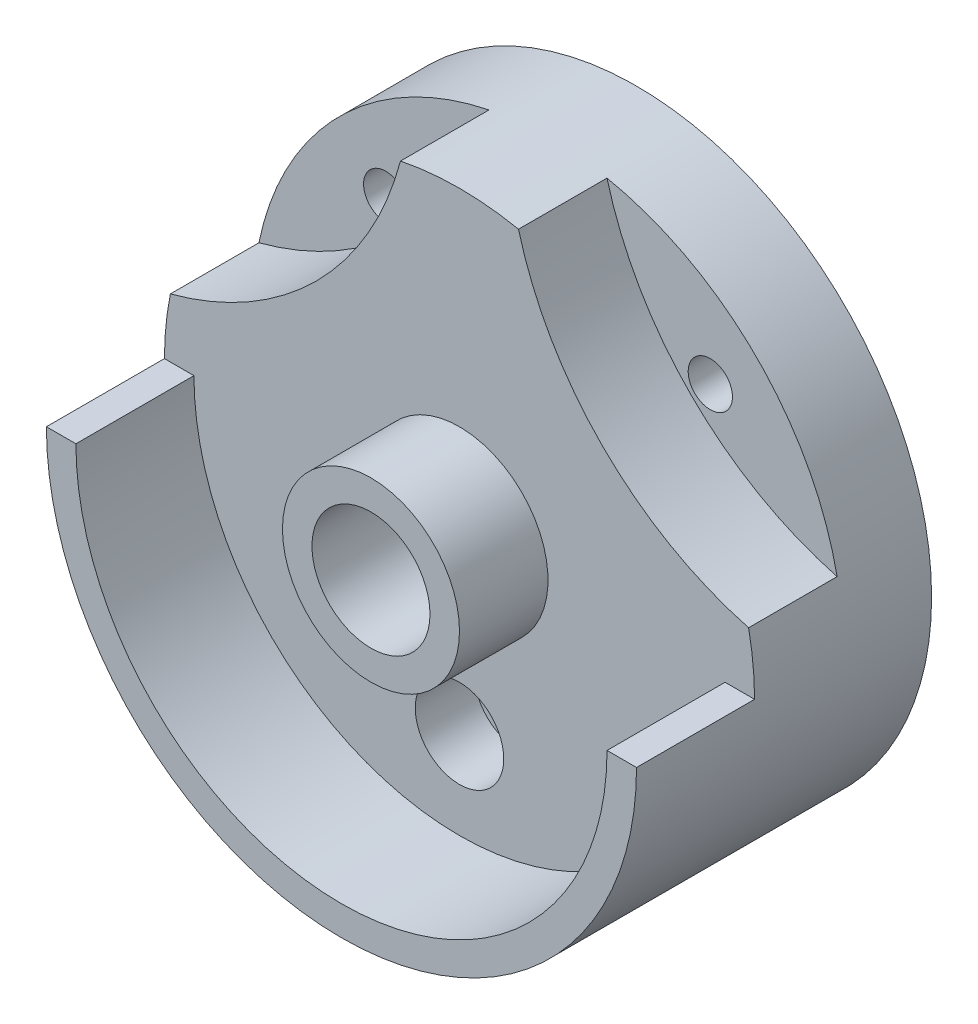
ISO-10303-21;
HEADER;
FILE_DESCRIPTION(('STEP AP214'),'2;1');
FILE_NAME('part.step','',(''),(''),'','','');
FILE_SCHEMA(('AUTOMOTIVE_DESIGN { 1 0 10303 214 1 1 1 1 }'));
ENDSEC;
DATA;
#1=APPLICATION_CONTEXT('core data for automotive mechanical design processes');
#2=APPLICATION_PROTOCOL_DEFINITION('international standard','automotive_design',2000,#1);
#3=PRODUCT_CONTEXT('',#1,'mechanical');
#4=PRODUCT('Part','Part','',(#3));
#5=PRODUCT_RELATED_PRODUCT_CATEGORY('part','',(#4));
#6=PRODUCT_DEFINITION_FORMATION('','',#4);
#7=PRODUCT_DEFINITION_CONTEXT('part definition',#1,'design');
#8=PRODUCT_DEFINITION('design','',#6,#7);
#9=PRODUCT_DEFINITION_SHAPE('','',#8);
#10=(LENGTH_UNIT() NAMED_UNIT(*) SI_UNIT(.MILLI.,.METRE.));
#11=(NAMED_UNIT(*) PLANE_ANGLE_UNIT() SI_UNIT($,.RADIAN.));
#12=(NAMED_UNIT(*) SI_UNIT($,.STERADIAN.) SOLID_ANGLE_UNIT());
#13=UNCERTAINTY_MEASURE_WITH_UNIT(LENGTH_MEASURE(1.E-05),#10,'distance_accuracy_value','');
#14=(GEOMETRIC_REPRESENTATION_CONTEXT(3) GLOBAL_UNCERTAINTY_ASSIGNED_CONTEXT((#13)) GLOBAL_UNIT_ASSIGNED_CONTEXT((#10,
#11,#12)) REPRESENTATION_CONTEXT('',''));
#15=CARTESIAN_POINT('',(0.,0.,0.));
#16=DIRECTION('',(0.,0.,1.));
#17=DIRECTION('',(1.,0.,0.));
#18=AXIS2_PLACEMENT_3D('',#15,#16,#17);
#19=CARTESIAN_POINT('',(0.,0.,60.));
#20=DIRECTION('',(0.,0.,-1.));
#21=DIRECTION('',(-1.,0.,0.));
#22=AXIS2_PLACEMENT_3D('',#19,#20,#21);
#23=PLANE('',#22);
#24=DIRECTION('',(-1.,0.,0.));
#25=VECTOR('',#24,1.);
#26=CARTESIAN_POINT('',(90.,0.,60.));
#27=LINE('',#26,#25);
#28=CARTESIAN_POINT('',(100.,0.,60.));
#29=VERTEX_POINT('',#28);
#30=CARTESIAN_POINT('',(90.,0.,60.));
#31=VERTEX_POINT('',#30);
#32=EDGE_CURVE('E116',#29,#31,#27,.T.);
#33=ORIENTED_EDGE('',*,*,#32,.F.);
#34=CARTESIAN_POINT('',(0.,0.,60.));
#35=DIRECTION('',(0.,0.,-1.));
#36=DIRECTION('',(-1.,0.,0.));
#37=AXIS2_PLACEMENT_3D('',#34,#35,#36);
#38=CIRCLE('',#37,100.);
#39=CARTESIAN_POINT('',(97.9795897113271,20.,60.));
#40=VERTEX_POINT('',#39);
#41=EDGE_CURVE('E136',#40,#29,#38,.T.);
#42=ORIENTED_EDGE('',*,*,#41,.F.);
#43=CARTESIAN_POINT('',(126.293553273105,126.293553273105,60.));
#44=DIRECTION('',(0.,0.,-1.));
#45=DIRECTION('',(-1.,0.,0.));
#46=AXIS2_PLACEMENT_3D('',#43,#44,#45);
#47=CIRCLE('',#46,110.);
#48=CARTESIAN_POINT('',(20.,97.9795897113271,60.));
#49=VERTEX_POINT('',#48);
#50=EDGE_CURVE('E42',#49,#40,#47,.F.);
#51=ORIENTED_EDGE('',*,*,#50,.F.);
#52=CARTESIAN_POINT('',(-20.,97.9795897113271,60.));
#53=VERTEX_POINT('',#52);
#54=EDGE_CURVE('E119',#53,#49,#38,.T.);
#55=ORIENTED_EDGE('',*,*,#54,.F.);
#56=CARTESIAN_POINT('',(-126.293553273105,126.293553273105,60.));
#57=DIRECTION('',(0.,0.,-1.));
#58=DIRECTION('',(-1.,0.,0.));
#59=AXIS2_PLACEMENT_3D('',#56,#57,#58);
#60=CIRCLE('',#59,110.);
#61=CARTESIAN_POINT('',(-97.9795897113271,20.,60.));
#62=VERTEX_POINT('',#61);
#63=EDGE_CURVE('E121',#53,#62,#60,.T.);
#64=ORIENTED_EDGE('',*,*,#63,.T.);
#65=CARTESIAN_POINT('',(-100.,0.,60.));
#66=VERTEX_POINT('',#65);
#67=EDGE_CURVE('E133',#66,#62,#38,.T.);
#68=ORIENTED_EDGE('',*,*,#67,.F.);
#69=DIRECTION('',(-1.,0.,0.));
#70=VECTOR('',#69,1.);
#71=CARTESIAN_POINT('',(-100.,0.,60.));
#72=LINE('',#71,#70);
#73=CARTESIAN_POINT('',(-90.,0.,60.));
#74=VERTEX_POINT('',#73);
#75=EDGE_CURVE('E54',#74,#66,#72,.T.);
#76=ORIENTED_EDGE('',*,*,#75,.F.);
#77=CARTESIAN_POINT('',(0.,0.,60.));
#78=DIRECTION('',(0.,0.,-1.));
#79=DIRECTION('',(1.,0.,0.));
#80=AXIS2_PLACEMENT_3D('',#77,#78,#79);
#81=CIRCLE('',#80,90.);
#82=EDGE_CURVE('E49',#31,#74,#81,.T.);
#83=ORIENTED_EDGE('',*,*,#82,.F.);
#84=EDGE_LOOP('',(#33,#42,#51,#55,#64,#68,#76,#83));
#85=FACE_BOUND('',#84,.T.);
#86=CARTESIAN_POINT('',(0.,-60.,60.));
#87=DIRECTION('',(0.,0.,1.));
#88=DIRECTION('',(1.,0.,0.));
#89=AXIS2_PLACEMENT_3D('',#86,#87,#88);
#90=CIRCLE('',#89,15.);
#91=CARTESIAN_POINT('',(15.,-60.,60.));
#92=VERTEX_POINT('',#91);
#93=EDGE_CURVE('E208',#92,#92,#90,.T.);
#94=ORIENTED_EDGE('',*,*,#93,.F.);
#95=EDGE_LOOP('',(#94));
#96=FACE_BOUND('',#95,.T.);
#97=CARTESIAN_POINT('',(0.,0.,60.));
#98=DIRECTION('',(0.,0.,-1.));
#99=DIRECTION('',(-1.,0.,0.));
#100=AXIS2_PLACEMENT_3D('',#97,#98,#99);
#101=CIRCLE('',#100,30.);
#102=CARTESIAN_POINT('',(-30.,0.,60.));
#103=VERTEX_POINT('',#102);
#104=EDGE_CURVE('E11',#103,#103,#101,.F.);
#105=ORIENTED_EDGE('',*,*,#104,.F.);
#106=EDGE_LOOP('',(#105));
#107=FACE_BOUND('',#106,.T.);
#108=ADVANCED_FACE('F33',(#85,#96,#107),#23,.F.);
#109=CARTESIAN_POINT('',(0.,-60.,-49.));
#110=DIRECTION('',(0.,0.,1.));
#111=DIRECTION('',(1.,0.,0.));
#112=AXIS2_PLACEMENT_3D('',#109,#110,#111);
#113=CYLINDRICAL_SURFACE('',#112,5.);
#114=CARTESIAN_POINT('',(0.,-60.,40.));
#115=DIRECTION('',(0.,0.,1.));
#116=DIRECTION('',(1.,0.,0.));
#117=AXIS2_PLACEMENT_3D('',#114,#115,#116);
#118=CIRCLE('',#117,5.);
#119=CARTESIAN_POINT('',(5.,-60.,40.));
#120=VERTEX_POINT('',#119);
#121=EDGE_CURVE('E203',#120,#120,#118,.T.);
#122=ORIENTED_EDGE('',*,*,#121,.T.);
#123=EDGE_LOOP('',(#122));
#124=FACE_BOUND('',#123,.T.);
#125=CARTESIAN_POINT('',(0.,-60.,20.));
#126=DIRECTION('',(0.,0.,-1.));
#127=DIRECTION('',(-1.,0.,0.));
#128=AXIS2_PLACEMENT_3D('',#125,#126,#127);
#129=CIRCLE('',#128,5.);
#130=CARTESIAN_POINT('',(-5.,-60.,20.));
#131=VERTEX_POINT('',#130);
#132=EDGE_CURVE('E201',#131,#131,#129,.F.);
#133=ORIENTED_EDGE('',*,*,#132,.F.);
#134=EDGE_LOOP('',(#133));
#135=FACE_BOUND('',#134,.T.);
#136=ADVANCED_FACE('F258',(#124,#135),#113,.F.);
#137=CARTESIAN_POINT('',(0.,0.,100.));
#138=DIRECTION('',(0.,0.,-1.));
#139=DIRECTION('',(-1.,0.,0.));
#140=AXIS2_PLACEMENT_3D('',#137,#138,#139);
#141=CYLINDRICAL_SURFACE('',#140,100.);
#142=CARTESIAN_POINT('',(0.,0.,0.));
#143=DIRECTION('',(0.,0.,1.));
#144=DIRECTION('',(1.,0.,0.));
#145=AXIS2_PLACEMENT_3D('',#142,#143,#144);
#146=CIRCLE('',#145,100.);
#147=CARTESIAN_POINT('',(100.,0.,0.));
#148=VERTEX_POINT('',#147);
#149=EDGE_CURVE('E142',#148,#148,#146,.T.);
#150=ORIENTED_EDGE('',*,*,#149,.T.);
#151=EDGE_LOOP('',(#150));
#152=FACE_BOUND('',#151,.T.);
#153=DIRECTION('',(0.,0.,1.));
#154=VECTOR('',#153,1.);
#155=CARTESIAN_POINT('',(-20.,97.9795897113271,30.));
#156=LINE('',#155,#154);
#157=CARTESIAN_POINT('',(-20.,97.9795897113271,30.));
#158=VERTEX_POINT('',#157);
#159=EDGE_CURVE('E155',#158,#53,#156,.T.);
#160=ORIENTED_EDGE('',*,*,#159,.T.);
#161=ORIENTED_EDGE('',*,*,#54,.T.);
#162=DIRECTION('',(0.,0.,1.));
#163=VECTOR('',#162,1.);
#164=CARTESIAN_POINT('',(20.,97.9795897113271,30.));
#165=LINE('',#164,#163);
#166=CARTESIAN_POINT('',(20.,97.9795897113271,30.));
#167=VERTEX_POINT('',#166);
#168=EDGE_CURVE('E169',#167,#49,#165,.T.);
#169=ORIENTED_EDGE('',*,*,#168,.F.);
#170=CARTESIAN_POINT('',(0.,0.,30.));
#171=DIRECTION('',(0.,0.,1.));
#172=DIRECTION('',(1.,0.,0.));
#173=AXIS2_PLACEMENT_3D('',#170,#171,#172);
#174=CIRCLE('',#173,100.);
#175=CARTESIAN_POINT('',(97.9795897113271,20.,30.));
#176=VERTEX_POINT('',#175);
#177=EDGE_CURVE('E139',#176,#167,#174,.T.);
#178=ORIENTED_EDGE('',*,*,#177,.F.);
#179=DIRECTION('',(0.,0.,1.));
#180=VECTOR('',#179,1.);
#181=CARTESIAN_POINT('',(97.9795897113271,20.,30.));
#182=LINE('',#181,#180);
#183=EDGE_CURVE('E168',#176,#40,#182,.T.);
#184=ORIENTED_EDGE('',*,*,#183,.T.);
#185=ORIENTED_EDGE('',*,*,#41,.T.);
#186=DIRECTION('',(0.,0.,-1.));
#187=VECTOR('',#186,1.);
#188=CARTESIAN_POINT('',(100.,0.,100.));
#189=LINE('',#188,#187);
#190=CARTESIAN_POINT('',(100.,0.,100.));
#191=VERTEX_POINT('',#190);
#192=EDGE_CURVE('E123',#191,#29,#189,.T.);
#193=ORIENTED_EDGE('',*,*,#192,.F.);
#194=CARTESIAN_POINT('',(0.,0.,100.));
#195=DIRECTION('',(0.,0.,1.));
#196=DIRECTION('',(1.,0.,0.));
#197=AXIS2_PLACEMENT_3D('',#194,#195,#196);
#198=CIRCLE('',#197,100.);
#199=CARTESIAN_POINT('',(-100.,0.,100.));
#200=VERTEX_POINT('',#199);
#201=EDGE_CURVE('E106',#200,#191,#198,.T.);
#202=ORIENTED_EDGE('',*,*,#201,.F.);
#203=DIRECTION('',(0.,0.,-1.));
#204=VECTOR('',#203,1.);
#205=CARTESIAN_POINT('',(-100.,0.,100.));
#206=LINE('',#205,#204);
#207=EDGE_CURVE('E103',#200,#66,#206,.T.);
#208=ORIENTED_EDGE('',*,*,#207,.T.);
#209=ORIENTED_EDGE('',*,*,#67,.T.);
#210=DIRECTION('',(0.,0.,1.));
#211=VECTOR('',#210,1.);
#212=CARTESIAN_POINT('',(-97.9795897113271,20.,30.));
#213=LINE('',#212,#211);
#214=CARTESIAN_POINT('',(-97.9795897113271,20.,30.));
#215=VERTEX_POINT('',#214);
#216=EDGE_CURVE('E154',#215,#62,#213,.T.);
#217=ORIENTED_EDGE('',*,*,#216,.F.);
#218=CARTESIAN_POINT('',(0.,0.,30.));
#219=DIRECTION('',(0.,0.,1.));
#220=DIRECTION('',(1.,0.,0.));
#221=AXIS2_PLACEMENT_3D('',#218,#219,#220);
#222=CIRCLE('',#221,100.);
#223=EDGE_CURVE('E158',#158,#215,#222,.T.);
#224=ORIENTED_EDGE('',*,*,#223,.F.);
#225=EDGE_LOOP('',(#160,#161,#169,#178,#184,#185,#193,#202,#208,#209,#217,#224));
#226=FACE_BOUND('',#225,.T.);
#227=ADVANCED_FACE('F35',(#152,#226),#141,.T.);
#228=CARTESIAN_POINT('',(0.,0.,0.));
#229=DIRECTION('',(0.,0.,1.));
#230=DIRECTION('',(1.,0.,0.));
#231=AXIS2_PLACEMENT_3D('',#228,#229,#230);
#232=PLANE('',#231);
#233=CARTESIAN_POINT('',(0.,0.,0.));
#234=DIRECTION('',(0.,0.,1.));
#235=DIRECTION('',(1.,0.,0.));
#236=AXIS2_PLACEMENT_3D('',#233,#234,#235);
#237=CIRCLE('',#236,20.);
#238=CARTESIAN_POINT('',(20.,0.,0.));
#239=VERTEX_POINT('',#238);
#240=EDGE_CURVE('E37',#239,#239,#237,.T.);
#241=ORIENTED_EDGE('',*,*,#240,.T.);
#242=EDGE_LOOP('',(#241));
#243=FACE_BOUND('',#242,.T.);
#244=CARTESIAN_POINT('',(0.,-60.,0.));
#245=DIRECTION('',(0.,0.,-1.));
#246=DIRECTION('',(-1.,0.,0.));
#247=AXIS2_PLACEMENT_3D('',#244,#245,#246);
#248=CIRCLE('',#247,25.);
#249=CARTESIAN_POINT('',(-25.,-60.,0.));
#250=VERTEX_POINT('',#249);
#251=EDGE_CURVE('E211',#250,#250,#248,.T.);
#252=ORIENTED_EDGE('',*,*,#251,.F.);
#253=EDGE_LOOP('',(#252));
#254=FACE_BOUND('',#253,.T.);
#255=CARTESIAN_POINT('',(-55.,55.,0.));
#256=DIRECTION('',(0.,0.,-1.));
#257=DIRECTION('',(-1.,0.,0.));
#258=AXIS2_PLACEMENT_3D('',#255,#256,#257);
#259=CIRCLE('',#258,7.5);
#260=CARTESIAN_POINT('',(-62.5,55.,0.));
#261=VERTEX_POINT('',#260);
#262=EDGE_CURVE('E148',#261,#261,#259,.T.);
#263=ORIENTED_EDGE('',*,*,#262,.F.);
#264=EDGE_LOOP('',(#263));
#265=FACE_BOUND('',#264,.T.);
#266=CARTESIAN_POINT('',(55.,55.,0.));
#267=DIRECTION('',(0.,0.,-1.));
#268=DIRECTION('',(-1.,0.,0.));
#269=AXIS2_PLACEMENT_3D('',#266,#267,#268);
#270=CIRCLE('',#269,7.5);
#271=CARTESIAN_POINT('',(47.5,55.,0.));
#272=VERTEX_POINT('',#271);
#273=EDGE_CURVE('E145',#272,#272,#270,.T.);
#274=ORIENTED_EDGE('',*,*,#273,.F.);
#275=EDGE_LOOP('',(#274));
#276=FACE_BOUND('',#275,.T.);
#277=ORIENTED_EDGE('',*,*,#149,.F.);
#278=EDGE_LOOP('',(#277));
#279=FACE_BOUND('',#278,.T.);
#280=ADVANCED_FACE('F249',(#243,#254,#265,#276,#279),#232,.F.);
#281=CARTESIAN_POINT('',(55.,55.,30.));
#282=DIRECTION('',(0.,0.,-1.));
#283=DIRECTION('',(-1.,0.,0.));
#284=AXIS2_PLACEMENT_3D('',#281,#282,#283);
#285=CYLINDRICAL_SURFACE('',#284,7.5);
#286=CARTESIAN_POINT('',(55.,55.,30.));
#287=DIRECTION('',(0.,0.,1.));
#288=DIRECTION('',(1.,0.,0.));
#289=AXIS2_PLACEMENT_3D('',#286,#287,#288);
#290=CIRCLE('',#289,7.5);
#291=CARTESIAN_POINT('',(62.5,55.,30.));
#292=VERTEX_POINT('',#291);
#293=EDGE_CURVE('E165',#292,#292,#290,.F.);
#294=ORIENTED_EDGE('',*,*,#293,.F.);
#295=EDGE_LOOP('',(#294));
#296=FACE_BOUND('',#295,.T.);
#297=ORIENTED_EDGE('',*,*,#273,.T.);
#298=EDGE_LOOP('',(#297));
#299=FACE_BOUND('',#298,.T.);
#300=ADVANCED_FACE('F245',(#296,#299),#285,.F.);
#301=CARTESIAN_POINT('',(-55.,55.,30.));
#302=DIRECTION('',(0.,0.,-1.));
#303=DIRECTION('',(-1.,0.,0.));
#304=AXIS2_PLACEMENT_3D('',#301,#302,#303);
#305=CYLINDRICAL_SURFACE('',#304,7.5);
#306=CARTESIAN_POINT('',(-55.,55.,30.));
#307=DIRECTION('',(0.,0.,1.));
#308=DIRECTION('',(1.,0.,0.));
#309=AXIS2_PLACEMENT_3D('',#306,#307,#308);
#310=CIRCLE('',#309,7.5);
#311=CARTESIAN_POINT('',(-47.5,55.,30.));
#312=VERTEX_POINT('',#311);
#313=EDGE_CURVE('E151',#312,#312,#310,.F.);
#314=ORIENTED_EDGE('',*,*,#313,.F.);
#315=EDGE_LOOP('',(#314));
#316=FACE_BOUND('',#315,.T.);
#317=ORIENTED_EDGE('',*,*,#262,.T.);
#318=EDGE_LOOP('',(#317));
#319=FACE_BOUND('',#318,.T.);
#320=ADVANCED_FACE('F239',(#316,#319),#305,.F.);
#321=CARTESIAN_POINT('',(0.,0.,30.));
#322=DIRECTION('',(0.,0.,1.));
#323=DIRECTION('',(1.,0.,0.));
#324=AXIS2_PLACEMENT_3D('',#321,#322,#323);
#325=PLANE('',#324);
#326=CARTESIAN_POINT('',(-126.293553273105,126.293553273105,30.));
#327=DIRECTION('',(0.,0.,1.));
#328=DIRECTION('',(1.,0.,0.));
#329=AXIS2_PLACEMENT_3D('',#326,#327,#328);
#330=CIRCLE('',#329,110.);
#331=EDGE_CURVE('E163',#158,#215,#330,.F.);
#332=ORIENTED_EDGE('',*,*,#331,.F.);
#333=ORIENTED_EDGE('',*,*,#223,.T.);
#334=EDGE_LOOP('',(#332,#333));
#335=FACE_BOUND('',#334,.T.);
#336=ORIENTED_EDGE('',*,*,#313,.T.);
#337=EDGE_LOOP('',(#336));
#338=FACE_BOUND('',#337,.T.);
#339=ADVANCED_FACE('F236',(#335,#338),#325,.T.);
#340=CARTESIAN_POINT('',(-126.293553273105,126.293553273105,30.));
#341=DIRECTION('',(0.,0.,1.));
#342=DIRECTION('',(1.,0.,0.));
#343=AXIS2_PLACEMENT_3D('',#340,#341,#342);
#344=CYLINDRICAL_SURFACE('',#343,110.);
#345=ORIENTED_EDGE('',*,*,#63,.F.);
#346=ORIENTED_EDGE('',*,*,#159,.F.);
#347=ORIENTED_EDGE('',*,*,#331,.T.);
#348=ORIENTED_EDGE('',*,*,#216,.T.);
#349=EDGE_LOOP('',(#345,#346,#347,#348));
#350=FACE_BOUND('',#349,.T.);
#351=ADVANCED_FACE('F233',(#350),#344,.F.);
#352=CARTESIAN_POINT('',(0.,0.,30.));
#353=DIRECTION('',(0.,0.,1.));
#354=DIRECTION('',(1.,0.,0.));
#355=AXIS2_PLACEMENT_3D('',#352,#353,#354);
#356=PLANE('',#355);
#357=ORIENTED_EDGE('',*,*,#177,.T.);
#358=CARTESIAN_POINT('',(126.293553273105,126.293553273105,30.));
#359=DIRECTION('',(0.,0.,1.));
#360=DIRECTION('',(1.,0.,0.));
#361=AXIS2_PLACEMENT_3D('',#358,#359,#360);
#362=CIRCLE('',#361,110.);
#363=EDGE_CURVE('E172',#167,#176,#362,.T.);
#364=ORIENTED_EDGE('',*,*,#363,.T.);
#365=EDGE_LOOP('',(#357,#364));
#366=FACE_BOUND('',#365,.T.);
#367=ORIENTED_EDGE('',*,*,#293,.T.);
#368=EDGE_LOOP('',(#367));
#369=FACE_BOUND('',#368,.T.);
#370=ADVANCED_FACE('F179',(#366,#369),#356,.T.);
#371=CARTESIAN_POINT('',(126.293553273105,126.293553273105,30.));
#372=DIRECTION('',(0.,0.,1.));
#373=DIRECTION('',(1.,0.,0.));
#374=AXIS2_PLACEMENT_3D('',#371,#372,#373);
#375=CYLINDRICAL_SURFACE('',#374,110.);
#376=ORIENTED_EDGE('',*,*,#168,.T.);
#377=ORIENTED_EDGE('',*,*,#50,.T.);
#378=ORIENTED_EDGE('',*,*,#183,.F.);
#379=ORIENTED_EDGE('',*,*,#363,.F.);
#380=EDGE_LOOP('',(#376,#377,#378,#379));
#381=FACE_BOUND('',#380,.T.);
#382=ADVANCED_FACE('F184',(#381),#375,.F.);
#383=CARTESIAN_POINT('',(0.,0.,100.));
#384=DIRECTION('',(0.,0.,-1.));
#385=DIRECTION('',(-1.,0.,0.));
#386=AXIS2_PLACEMENT_3D('',#383,#384,#385);
#387=CYLINDRICAL_SURFACE('',#386,90.);
#388=ORIENTED_EDGE('',*,*,#82,.T.);
#389=DIRECTION('',(0.,0.,-1.));
#390=VECTOR('',#389,1.);
#391=CARTESIAN_POINT('',(-90.,0.,100.));
#392=LINE('',#391,#390);
#393=CARTESIAN_POINT('',(-90.,0.,100.));
#394=VERTEX_POINT('',#393);
#395=EDGE_CURVE('E101',#394,#74,#392,.T.);
#396=ORIENTED_EDGE('',*,*,#395,.F.);
#397=CARTESIAN_POINT('',(0.,0.,100.));
#398=DIRECTION('',(0.,0.,-1.));
#399=DIRECTION('',(1.,0.,0.));
#400=AXIS2_PLACEMENT_3D('',#397,#398,#399);
#401=CIRCLE('',#400,90.);
#402=CARTESIAN_POINT('',(90.,0.,100.));
#403=VERTEX_POINT('',#402);
#404=EDGE_CURVE('E107',#403,#394,#401,.T.);
#405=ORIENTED_EDGE('',*,*,#404,.F.);
#406=DIRECTION('',(0.,0.,-1.));
#407=VECTOR('',#406,1.);
#408=CARTESIAN_POINT('',(90.,0.,100.));
#409=LINE('',#408,#407);
#410=EDGE_CURVE('E126',#403,#31,#409,.T.);
#411=ORIENTED_EDGE('',*,*,#410,.T.);
#412=EDGE_LOOP('',(#388,#396,#405,#411));
#413=FACE_BOUND('',#412,.T.);
#414=ADVANCED_FACE('F118',(#413),#387,.F.);
#415=CARTESIAN_POINT('',(-100.,0.,100.));
#416=DIRECTION('',(0.,-1.,0.));
#417=DIRECTION('',(1.,0.,0.));
#418=AXIS2_PLACEMENT_3D('',#415,#416,#417);
#419=PLANE('',#418);
#420=ORIENTED_EDGE('',*,*,#75,.T.);
#421=ORIENTED_EDGE('',*,*,#207,.F.);
#422=DIRECTION('',(-1.,0.,0.));
#423=VECTOR('',#422,1.);
#424=CARTESIAN_POINT('',(-100.,0.,100.));
#425=LINE('',#424,#423);
#426=EDGE_CURVE('E97',#394,#200,#425,.T.);
#427=ORIENTED_EDGE('',*,*,#426,.F.);
#428=ORIENTED_EDGE('',*,*,#395,.T.);
#429=EDGE_LOOP('',(#420,#421,#427,#428));
#430=FACE_BOUND('',#429,.T.);
#431=ADVANCED_FACE('F99',(#430),#419,.F.);
#432=CARTESIAN_POINT('',(90.,0.,100.));
#433=DIRECTION('',(0.,-1.,0.));
#434=DIRECTION('',(0.,0.,-1.));
#435=AXIS2_PLACEMENT_3D('',#432,#433,#434);
#436=PLANE('',#435);
#437=ORIENTED_EDGE('',*,*,#32,.T.);
#438=ORIENTED_EDGE('',*,*,#410,.F.);
#439=DIRECTION('',(-1.,0.,0.));
#440=VECTOR('',#439,1.);
#441=CARTESIAN_POINT('',(90.,0.,100.));
#442=LINE('',#441,#440);
#443=EDGE_CURVE('E112',#191,#403,#442,.T.);
#444=ORIENTED_EDGE('',*,*,#443,.F.);
#445=ORIENTED_EDGE('',*,*,#192,.T.);
#446=EDGE_LOOP('',(#437,#438,#444,#445));
#447=FACE_BOUND('',#446,.T.);
#448=ADVANCED_FACE('F193',(#447),#436,.F.);
#449=CARTESIAN_POINT('',(0.,0.,100.));
#450=DIRECTION('',(0.,0.,1.));
#451=DIRECTION('',(1.,0.,0.));
#452=AXIS2_PLACEMENT_3D('',#449,#450,#451);
#453=PLANE('',#452);
#454=ORIENTED_EDGE('',*,*,#404,.T.);
#455=ORIENTED_EDGE('',*,*,#426,.T.);
#456=ORIENTED_EDGE('',*,*,#201,.T.);
#457=ORIENTED_EDGE('',*,*,#443,.T.);
#458=EDGE_LOOP('',(#454,#455,#456,#457));
#459=FACE_BOUND('',#458,.T.);
#460=ADVANCED_FACE('F110',(#459),#453,.T.);
#461=CARTESIAN_POINT('',(0.,-60.,40.));
#462=DIRECTION('',(0.,0.,1.));
#463=DIRECTION('',(1.,0.,0.));
#464=AXIS2_PLACEMENT_3D('',#461,#462,#463);
#465=CYLINDRICAL_SURFACE('',#464,15.);
#466=CARTESIAN_POINT('',(0.,-60.,40.));
#467=DIRECTION('',(0.,0.,1.));
#468=DIRECTION('',(1.,0.,0.));
#469=AXIS2_PLACEMENT_3D('',#466,#467,#468);
#470=CIRCLE('',#469,15.);
#471=CARTESIAN_POINT('',(15.,-60.,40.));
#472=VERTEX_POINT('',#471);
#473=EDGE_CURVE('E221',#472,#472,#470,.T.);
#474=ORIENTED_EDGE('',*,*,#473,.F.);
#475=EDGE_LOOP('',(#474));
#476=FACE_BOUND('',#475,.T.);
#477=ORIENTED_EDGE('',*,*,#93,.T.);
#478=EDGE_LOOP('',(#477));
#479=FACE_BOUND('',#478,.T.);
#480=ADVANCED_FACE('F327',(#476,#479),#465,.F.);
#481=CARTESIAN_POINT('',(0.,-60.,40.));
#482=DIRECTION('',(0.,0.,1.));
#483=DIRECTION('',(1.,0.,0.));
#484=AXIS2_PLACEMENT_3D('',#481,#482,#483);
#485=PLANE('',#484);
#486=ORIENTED_EDGE('',*,*,#121,.F.);
#487=EDGE_LOOP('',(#486));
#488=FACE_BOUND('',#487,.T.);
#489=ORIENTED_EDGE('',*,*,#473,.T.);
#490=EDGE_LOOP('',(#489));
#491=FACE_BOUND('',#490,.T.);
#492=ADVANCED_FACE('F334',(#488,#491),#485,.T.);
#493=CARTESIAN_POINT('',(0.,-60.,20.));
#494=DIRECTION('',(0.,0.,-1.));
#495=DIRECTION('',(-1.,0.,0.));
#496=AXIS2_PLACEMENT_3D('',#493,#494,#495);
#497=PLANE('',#496);
#498=CARTESIAN_POINT('',(0.,-60.,20.));
#499=DIRECTION('',(0.,0.,-1.));
#500=DIRECTION('',(-1.,0.,0.));
#501=AXIS2_PLACEMENT_3D('',#498,#499,#500);
#502=CIRCLE('',#501,25.);
#503=CARTESIAN_POINT('',(-25.,-60.,20.));
#504=VERTEX_POINT('',#503);
#505=EDGE_CURVE('E204',#504,#504,#502,.T.);
#506=ORIENTED_EDGE('',*,*,#505,.T.);
#507=EDGE_LOOP('',(#506));
#508=FACE_BOUND('',#507,.T.);
#509=ORIENTED_EDGE('',*,*,#132,.T.);
#510=EDGE_LOOP('',(#509));
#511=FACE_BOUND('',#510,.T.);
#512=ADVANCED_FACE('F342',(#508,#511),#497,.T.);
#513=CARTESIAN_POINT('',(0.,-60.,20.));
#514=DIRECTION('',(0.,0.,-1.));
#515=DIRECTION('',(-1.,0.,0.));
#516=AXIS2_PLACEMENT_3D('',#513,#514,#515);
#517=CYLINDRICAL_SURFACE('',#516,25.);
#518=ORIENTED_EDGE('',*,*,#505,.F.);
#519=EDGE_LOOP('',(#518));
#520=FACE_BOUND('',#519,.T.);
#521=ORIENTED_EDGE('',*,*,#251,.T.);
#522=EDGE_LOOP('',(#521));
#523=FACE_BOUND('',#522,.T.);
#524=ADVANCED_FACE('F351',(#520,#523),#517,.F.);
#525=CARTESIAN_POINT('',(0.,0.,90.));
#526=DIRECTION('',(0.,0.,-1.));
#527=DIRECTION('',(-1.,0.,0.));
#528=AXIS2_PLACEMENT_3D('',#525,#526,#527);
#529=CYLINDRICAL_SURFACE('',#528,30.);
#530=CARTESIAN_POINT('',(0.,0.,90.));
#531=DIRECTION('',(0.,0.,1.));
#532=DIRECTION('',(1.,0.,0.));
#533=AXIS2_PLACEMENT_3D('',#530,#531,#532);
#534=CIRCLE('',#533,30.);
#535=CARTESIAN_POINT('',(30.,0.,90.));
#536=VERTEX_POINT('',#535);
#537=EDGE_CURVE('E216',#536,#536,#534,.T.);
#538=ORIENTED_EDGE('',*,*,#537,.F.);
#539=EDGE_LOOP('',(#538));
#540=FACE_BOUND('',#539,.T.);
#541=ORIENTED_EDGE('',*,*,#104,.T.);
#542=EDGE_LOOP('',(#541));
#543=FACE_BOUND('',#542,.T.);
#544=ADVANCED_FACE('F358',(#540,#543),#529,.T.);
#545=CARTESIAN_POINT('',(0.,0.,90.));
#546=DIRECTION('',(0.,0.,1.));
#547=DIRECTION('',(1.,0.,0.));
#548=AXIS2_PLACEMENT_3D('',#545,#546,#547);
#549=PLANE('',#548);
#550=CARTESIAN_POINT('',(0.,0.,90.));
#551=DIRECTION('',(0.,0.,1.));
#552=DIRECTION('',(1.,0.,0.));
#553=AXIS2_PLACEMENT_3D('',#550,#551,#552);
#554=CIRCLE('',#553,20.);
#555=CARTESIAN_POINT('',(20.,0.,90.));
#556=VERTEX_POINT('',#555);
#557=EDGE_CURVE('E445',#556,#556,#554,.T.);
#558=ORIENTED_EDGE('',*,*,#557,.F.);
#559=EDGE_LOOP('',(#558));
#560=FACE_BOUND('',#559,.T.);
#561=ORIENTED_EDGE('',*,*,#537,.T.);
#562=EDGE_LOOP('',(#561));
#563=FACE_BOUND('',#562,.T.);
#564=ADVANCED_FACE('F366',(#560,#563),#549,.T.);
#565=CARTESIAN_POINT('',(0.,0.,40.));
#566=DIRECTION('',(0.,0.,1.));
#567=DIRECTION('',(1.,0.,0.));
#568=AXIS2_PLACEMENT_3D('',#565,#566,#567);
#569=CYLINDRICAL_SURFACE('',#568,20.);
#570=ORIENTED_EDGE('',*,*,#557,.T.);
#571=EDGE_LOOP('',(#570));
#572=FACE_BOUND('',#571,.T.);
#573=ORIENTED_EDGE('',*,*,#240,.F.);
#574=EDGE_LOOP('',(#573));
#575=FACE_BOUND('',#574,.T.);
#576=ADVANCED_FACE('F374',(#572,#575),#569,.F.);
#577=CLOSED_SHELL('',(#108,#136,#227,#280,#300,#320,#339,#351,#370,#382,#414,#431,#448,#460,
#480,#492,#512,#524,#544,#564,#576));
#578=MANIFOLD_SOLID_BREP('B2',#577);
#579=ADVANCED_BREP_SHAPE_REPRESENTATION('',(#18,#578),#14);
#580=SHAPE_DEFINITION_REPRESENTATION(#9,#579);
ENDSEC;
END-ISO-10303-21;
